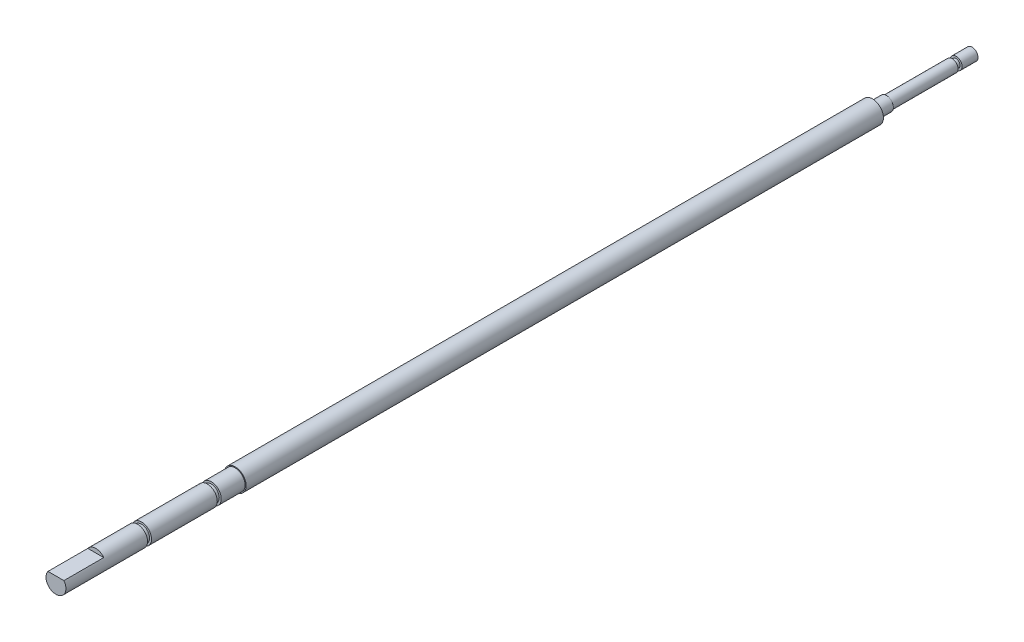
ISO-10303-21;
HEADER;
FILE_DESCRIPTION(('STEP AP214'),'2;1');
FILE_NAME('part.step','',(''),(''),'','','');
FILE_SCHEMA(('AUTOMOTIVE_DESIGN { 1 0 10303 214 1 1 1 1 }'));
ENDSEC;
DATA;
#1=APPLICATION_CONTEXT('core data for automotive mechanical design processes');
#2=APPLICATION_PROTOCOL_DEFINITION('international standard','automotive_design',2000,#1);
#3=PRODUCT_CONTEXT('',#1,'mechanical');
#4=PRODUCT('Part','Part','',(#3));
#5=PRODUCT_RELATED_PRODUCT_CATEGORY('part','',(#4));
#6=PRODUCT_DEFINITION_FORMATION('','',#4);
#7=PRODUCT_DEFINITION_CONTEXT('part definition',#1,'design');
#8=PRODUCT_DEFINITION('design','',#6,#7);
#9=PRODUCT_DEFINITION_SHAPE('','',#8);
#10=(LENGTH_UNIT() NAMED_UNIT(*) SI_UNIT(.MILLI.,.METRE.));
#11=(NAMED_UNIT(*) PLANE_ANGLE_UNIT() SI_UNIT($,.RADIAN.));
#12=(NAMED_UNIT(*) SI_UNIT($,.STERADIAN.) SOLID_ANGLE_UNIT());
#13=UNCERTAINTY_MEASURE_WITH_UNIT(LENGTH_MEASURE(1.E-05),#10,'distance_accuracy_value','');
#14=(GEOMETRIC_REPRESENTATION_CONTEXT(3) GLOBAL_UNCERTAINTY_ASSIGNED_CONTEXT((#13)) GLOBAL_UNIT_ASSIGNED_CONTEXT((#10,
#11,#12)) REPRESENTATION_CONTEXT('',''));
#15=CARTESIAN_POINT('',(0.,0.,0.));
#16=DIRECTION('',(0.,0.,1.));
#17=DIRECTION('',(1.,0.,0.));
#18=AXIS2_PLACEMENT_3D('',#15,#16,#17);
#19=CARTESIAN_POINT('',(-2.,1.5,220.));
#20=DIRECTION('',(0.,-1.,0.));
#21=DIRECTION('',(0.,0.,-1.));
#22=AXIS2_PLACEMENT_3D('',#19,#20,#21);
#23=PLANE('',#22);
#24=DIRECTION('',(-1.,0.,0.));
#25=VECTOR('',#24,1.);
#26=CARTESIAN_POINT('',(-2.,1.5,230.));
#27=LINE('',#26,#25);
#28=CARTESIAN_POINT('',(2.,1.5,230.));
#29=VERTEX_POINT('',#28);
#30=CARTESIAN_POINT('',(-2.,1.5,230.));
#31=VERTEX_POINT('',#30);
#32=EDGE_CURVE('E59',#29,#31,#27,.T.);
#33=ORIENTED_EDGE('',*,*,#32,.F.);
#34=DIRECTION('',(0.,0.,1.));
#35=VECTOR('',#34,1.);
#36=CARTESIAN_POINT('',(2.,1.5,220.));
#37=LINE('',#36,#35);
#38=CARTESIAN_POINT('',(2.,1.5,220.));
#39=VERTEX_POINT('',#38);
#40=EDGE_CURVE('E65',#39,#29,#37,.T.);
#41=ORIENTED_EDGE('',*,*,#40,.F.);
#42=DIRECTION('',(1.,0.,0.));
#43=VECTOR('',#42,1.);
#44=CARTESIAN_POINT('',(-2.,1.5,220.));
#45=LINE('',#44,#43);
#46=CARTESIAN_POINT('',(-2.,1.5,220.));
#47=VERTEX_POINT('',#46);
#48=EDGE_CURVE('E85',#47,#39,#45,.T.);
#49=ORIENTED_EDGE('',*,*,#48,.F.);
#50=DIRECTION('',(0.,0.,1.));
#51=VECTOR('',#50,1.);
#52=CARTESIAN_POINT('',(-2.,1.5,220.));
#53=LINE('',#52,#51);
#54=EDGE_CURVE('E75',#47,#31,#53,.T.);
#55=ORIENTED_EDGE('',*,*,#54,.T.);
#56=EDGE_LOOP('',(#33,#41,#49,#55));
#57=FACE_BOUND('',#56,.T.);
#58=ADVANCED_FACE('F45',(#57),#23,.F.);
#59=CARTESIAN_POINT('',(0.,0.,250.));
#60=DIRECTION('',(0.,0.,-1.));
#61=DIRECTION('',(-1.,0.,0.));
#62=AXIS2_PLACEMENT_3D('',#59,#60,#61);
#63=CYLINDRICAL_SURFACE('',#62,2.5);
#64=CARTESIAN_POINT('',(0.,0.,209.5));
#65=DIRECTION('',(0.,0.,1.));
#66=DIRECTION('',(1.,0.,0.));
#67=AXIS2_PLACEMENT_3D('',#64,#65,#66);
#68=CIRCLE('',#67,2.5);
#69=CARTESIAN_POINT('',(2.5,0.,209.5));
#70=VERTEX_POINT('',#69);
#71=EDGE_CURVE('E118',#70,#70,#68,.F.);
#72=ORIENTED_EDGE('',*,*,#71,.F.);
#73=EDGE_LOOP('',(#72));
#74=FACE_BOUND('',#73,.T.);
#75=ORIENTED_EDGE('',*,*,#40,.T.);
#76=CARTESIAN_POINT('',(0.,0.,230.));
#77=DIRECTION('',(0.,0.,1.));
#78=DIRECTION('',(1.,0.,0.));
#79=AXIS2_PLACEMENT_3D('',#76,#77,#78);
#80=CIRCLE('',#79,2.5);
#81=EDGE_CURVE('E13',#29,#31,#80,.F.);
#82=ORIENTED_EDGE('',*,*,#81,.T.);
#83=ORIENTED_EDGE('',*,*,#54,.F.);
#84=CARTESIAN_POINT('',(0.,0.,220.));
#85=DIRECTION('',(0.,0.,1.));
#86=DIRECTION('',(1.,0.,0.));
#87=AXIS2_PLACEMENT_3D('',#84,#85,#86);
#88=CIRCLE('',#87,2.5);
#89=EDGE_CURVE('E80',#39,#47,#88,.T.);
#90=ORIENTED_EDGE('',*,*,#89,.F.);
#91=EDGE_LOOP('',(#75,#82,#83,#90));
#92=FACE_BOUND('',#91,.T.);
#93=ADVANCED_FACE('F79',(#74,#92),#63,.T.);
#94=CARTESIAN_POINT('',(0.,0.,192.));
#95=DIRECTION('',(0.,0.,1.));
#96=DIRECTION('',(1.,0.,0.));
#97=AXIS2_PLACEMENT_3D('',#94,#95,#96);
#98=CIRCLE('',#97,2.5);
#99=CARTESIAN_POINT('',(2.5,0.,192.));
#100=VERTEX_POINT('',#99);
#101=EDGE_CURVE('E111',#100,#100,#98,.F.);
#102=ORIENTED_EDGE('',*,*,#101,.F.);
#103=EDGE_LOOP('',(#102));
#104=FACE_BOUND('',#103,.T.);
#105=CARTESIAN_POINT('',(0.,0.,208.5));
#106=DIRECTION('',(0.,0.,1.));
#107=DIRECTION('',(1.,0.,0.));
#108=AXIS2_PLACEMENT_3D('',#105,#106,#107);
#109=CIRCLE('',#108,2.5);
#110=CARTESIAN_POINT('',(2.5,0.,208.5));
#111=VERTEX_POINT('',#110);
#112=EDGE_CURVE('E116',#111,#111,#109,.F.);
#113=ORIENTED_EDGE('',*,*,#112,.T.);
#114=EDGE_LOOP('',(#113));
#115=FACE_BOUND('',#114,.T.);
#116=ADVANCED_FACE('F160',(#104,#115),#63,.T.);
#117=CARTESIAN_POINT('',(0.,0.,185.));
#118=DIRECTION('',(0.,0.,1.));
#119=DIRECTION('',(1.,0.,0.));
#120=AXIS2_PLACEMENT_3D('',#117,#118,#119);
#121=CIRCLE('',#120,2.5);
#122=CARTESIAN_POINT('',(2.5,0.,185.));
#123=VERTEX_POINT('',#122);
#124=EDGE_CURVE('E95',#123,#123,#121,.T.);
#125=ORIENTED_EDGE('',*,*,#124,.T.);
#126=EDGE_LOOP('',(#125));
#127=FACE_BOUND('',#126,.T.);
#128=CARTESIAN_POINT('',(0.,0.,191.));
#129=DIRECTION('',(0.,0.,1.));
#130=DIRECTION('',(1.,0.,0.));
#131=AXIS2_PLACEMENT_3D('',#128,#129,#130);
#132=CIRCLE('',#131,2.5);
#133=CARTESIAN_POINT('',(2.5,0.,191.));
#134=VERTEX_POINT('',#133);
#135=EDGE_CURVE('E108',#134,#134,#132,.F.);
#136=ORIENTED_EDGE('',*,*,#135,.T.);
#137=EDGE_LOOP('',(#136));
#138=FACE_BOUND('',#137,.T.);
#139=ADVANCED_FACE('F163',(#127,#138),#63,.T.);
#140=CARTESIAN_POINT('',(0.,0.,35.7019443787848));
#141=DIRECTION('',(0.,0.,-1.));
#142=DIRECTION('',(-1.,0.,0.));
#143=AXIS2_PLACEMENT_3D('',#140,#141,#142);
#144=CYLINDRICAL_SURFACE('',#143,1.5);
#145=CARTESIAN_POINT('',(0.,0.,21.5));
#146=DIRECTION('',(0.,0.,-1.));
#147=DIRECTION('',(-1.,0.,0.));
#148=AXIS2_PLACEMENT_3D('',#145,#146,#147);
#149=CIRCLE('',#148,1.5);
#150=CARTESIAN_POINT('',(-1.5,0.,21.5));
#151=VERTEX_POINT('',#150);
#152=EDGE_CURVE('E99',#151,#151,#149,.F.);
#153=ORIENTED_EDGE('',*,*,#152,.F.);
#154=EDGE_LOOP('',(#153));
#155=FACE_BOUND('',#154,.T.);
#156=CARTESIAN_POINT('',(0.,0.,5.));
#157=DIRECTION('',(0.,0.,-1.));
#158=DIRECTION('',(-1.,0.,0.));
#159=AXIS2_PLACEMENT_3D('',#156,#157,#158);
#160=CIRCLE('',#159,1.5);
#161=CARTESIAN_POINT('',(-1.5,0.,5.));
#162=VERTEX_POINT('',#161);
#163=EDGE_CURVE('E100',#162,#162,#160,.F.);
#164=ORIENTED_EDGE('',*,*,#163,.T.);
#165=EDGE_LOOP('',(#164));
#166=FACE_BOUND('',#165,.T.);
#167=ADVANCED_FACE('F168',(#155,#166),#144,.T.);
#168=CARTESIAN_POINT('',(0.,0.,25.));
#169=DIRECTION('',(0.,0.,-1.));
#170=DIRECTION('',(-1.,0.,0.));
#171=AXIS2_PLACEMENT_3D('',#168,#169,#170);
#172=CYLINDRICAL_SURFACE('',#171,1.75);
#173=CARTESIAN_POINT('',(0.,0.,25.));
#174=DIRECTION('',(0.,0.,-1.));
#175=DIRECTION('',(-1.,0.,0.));
#176=AXIS2_PLACEMENT_3D('',#173,#174,#175);
#177=CIRCLE('',#176,1.75);
#178=CARTESIAN_POINT('',(-1.75,0.,25.));
#179=VERTEX_POINT('',#178);
#180=EDGE_CURVE('E81',#179,#179,#177,.T.);
#181=ORIENTED_EDGE('',*,*,#180,.T.);
#182=EDGE_LOOP('',(#181));
#183=FACE_BOUND('',#182,.T.);
#184=CARTESIAN_POINT('',(0.,0.,21.5));
#185=DIRECTION('',(0.,0.,-1.));
#186=DIRECTION('',(-1.,0.,0.));
#187=AXIS2_PLACEMENT_3D('',#184,#185,#186);
#188=CIRCLE('',#187,1.75);
#189=CARTESIAN_POINT('',(-1.75,0.,21.5));
#190=VERTEX_POINT('',#189);
#191=EDGE_CURVE('E96',#190,#190,#188,.F.);
#192=ORIENTED_EDGE('',*,*,#191,.T.);
#193=EDGE_LOOP('',(#192));
#194=FACE_BOUND('',#193,.T.);
#195=ADVANCED_FACE('F165',(#183,#194),#172,.T.);
#196=CARTESIAN_POINT('',(0.,0.,250.));
#197=DIRECTION('',(0.,0.,-1.));
#198=DIRECTION('',(-1.,0.,0.));
#199=AXIS2_PLACEMENT_3D('',#196,#197,#198);
#200=CYLINDRICAL_SURFACE('',#199,2.75);
#201=CARTESIAN_POINT('',(0.,0.,25.));
#202=DIRECTION('',(0.,0.,-1.));
#203=DIRECTION('',(-1.,0.,0.));
#204=AXIS2_PLACEMENT_3D('',#201,#202,#203);
#205=CIRCLE('',#204,2.75);
#206=CARTESIAN_POINT('',(-2.75,0.,25.));
#207=VERTEX_POINT('',#206);
#208=EDGE_CURVE('E53',#207,#207,#205,.T.);
#209=ORIENTED_EDGE('',*,*,#208,.F.);
#210=EDGE_LOOP('',(#209));
#211=FACE_BOUND('',#210,.T.);
#212=CARTESIAN_POINT('',(0.,0.,185.));
#213=DIRECTION('',(0.,0.,1.));
#214=DIRECTION('',(1.,0.,0.));
#215=AXIS2_PLACEMENT_3D('',#212,#213,#214);
#216=CIRCLE('',#215,2.75);
#217=CARTESIAN_POINT('',(2.75,0.,185.));
#218=VERTEX_POINT('',#217);
#219=EDGE_CURVE('E92',#218,#218,#216,.T.);
#220=ORIENTED_EDGE('',*,*,#219,.F.);
#221=EDGE_LOOP('',(#220));
#222=FACE_BOUND('',#221,.T.);
#223=ADVANCED_FACE('F47',(#211,#222),#200,.T.);
#224=CARTESIAN_POINT('',(0.,0.,25.));
#225=DIRECTION('',(0.,0.,-1.));
#226=DIRECTION('',(-1.,0.,0.));
#227=AXIS2_PLACEMENT_3D('',#224,#225,#226);
#228=PLANE('',#227);
#229=ORIENTED_EDGE('',*,*,#180,.F.);
#230=EDGE_LOOP('',(#229));
#231=FACE_BOUND('',#230,.T.);
#232=ORIENTED_EDGE('',*,*,#208,.T.);
#233=EDGE_LOOP('',(#232));
#234=FACE_BOUND('',#233,.T.);
#235=ADVANCED_FACE('F170',(#231,#234),#228,.T.);
#236=CARTESIAN_POINT('',(0.,0.,185.));
#237=DIRECTION('',(0.,0.,1.));
#238=DIRECTION('',(1.,0.,0.));
#239=AXIS2_PLACEMENT_3D('',#236,#237,#238);
#240=PLANE('',#239);
#241=ORIENTED_EDGE('',*,*,#124,.F.);
#242=EDGE_LOOP('',(#241));
#243=FACE_BOUND('',#242,.T.);
#244=ORIENTED_EDGE('',*,*,#219,.T.);
#245=EDGE_LOOP('',(#244));
#246=FACE_BOUND('',#245,.T.);
#247=ADVANCED_FACE('F172',(#243,#246),#240,.T.);
#248=CARTESIAN_POINT('',(0.,0.,21.5));
#249=DIRECTION('',(0.,0.,-1.));
#250=DIRECTION('',(-1.,0.,0.));
#251=AXIS2_PLACEMENT_3D('',#248,#249,#250);
#252=PLANE('',#251);
#253=ORIENTED_EDGE('',*,*,#191,.F.);
#254=EDGE_LOOP('',(#253));
#255=FACE_BOUND('',#254,.T.);
#256=ORIENTED_EDGE('',*,*,#152,.T.);
#257=EDGE_LOOP('',(#256));
#258=FACE_BOUND('',#257,.T.);
#259=ADVANCED_FACE('F204',(#255,#258),#252,.T.);
#260=CARTESIAN_POINT('',(0.,0.,4.));
#261=DIRECTION('',(0.,0.,-1.));
#262=DIRECTION('',(-1.,0.,0.));
#263=AXIS2_PLACEMENT_3D('',#260,#261,#262);
#264=PLANE('',#263);
#265=CARTESIAN_POINT('',(0.,0.,4.));
#266=DIRECTION('',(0.,0.,-1.));
#267=DIRECTION('',(-1.,0.,0.));
#268=AXIS2_PLACEMENT_3D('',#265,#266,#267);
#269=CIRCLE('',#268,1.5);
#270=CARTESIAN_POINT('',(-1.5,0.,4.));
#271=VERTEX_POINT('',#270);
#272=EDGE_CURVE('E103',#271,#271,#269,.F.);
#273=ORIENTED_EDGE('',*,*,#272,.T.);
#274=EDGE_LOOP('',(#273));
#275=FACE_BOUND('',#274,.T.);
#276=CARTESIAN_POINT('',(0.,0.,4.));
#277=DIRECTION('',(0.,0.,-1.));
#278=DIRECTION('',(-1.,0.,0.));
#279=AXIS2_PLACEMENT_3D('',#276,#277,#278);
#280=CIRCLE('',#279,1.);
#281=CARTESIAN_POINT('',(-1.,0.,4.));
#282=VERTEX_POINT('',#281);
#283=EDGE_CURVE('E104',#282,#282,#280,.T.);
#284=ORIENTED_EDGE('',*,*,#283,.T.);
#285=EDGE_LOOP('',(#284));
#286=FACE_BOUND('',#285,.T.);
#287=ADVANCED_FACE('F194',(#275,#286),#264,.F.);
#288=CARTESIAN_POINT('',(0.,0.,5.));
#289=DIRECTION('',(0.,0.,-1.));
#290=DIRECTION('',(-1.,0.,0.));
#291=AXIS2_PLACEMENT_3D('',#288,#289,#290);
#292=PLANE('',#291);
#293=ORIENTED_EDGE('',*,*,#163,.F.);
#294=EDGE_LOOP('',(#293));
#295=FACE_BOUND('',#294,.T.);
#296=CARTESIAN_POINT('',(0.,0.,5.));
#297=DIRECTION('',(0.,0.,-1.));
#298=DIRECTION('',(-1.,0.,0.));
#299=AXIS2_PLACEMENT_3D('',#296,#297,#298);
#300=CIRCLE('',#299,1.);
#301=CARTESIAN_POINT('',(-1.,0.,5.));
#302=VERTEX_POINT('',#301);
#303=EDGE_CURVE('E115',#302,#302,#300,.T.);
#304=ORIENTED_EDGE('',*,*,#303,.F.);
#305=EDGE_LOOP('',(#304));
#306=FACE_BOUND('',#305,.T.);
#307=ADVANCED_FACE('F186',(#295,#306),#292,.T.);
#308=CARTESIAN_POINT('',(0.,0.,4.));
#309=DIRECTION('',(0.,0.,1.));
#310=DIRECTION('',(1.,0.,0.));
#311=AXIS2_PLACEMENT_3D('',#308,#309,#310);
#312=CYLINDRICAL_SURFACE('',#311,1.);
#313=ORIENTED_EDGE('',*,*,#283,.F.);
#314=EDGE_LOOP('',(#313));
#315=FACE_BOUND('',#314,.T.);
#316=ORIENTED_EDGE('',*,*,#303,.T.);
#317=EDGE_LOOP('',(#316));
#318=FACE_BOUND('',#317,.T.);
#319=ADVANCED_FACE('F177',(#315,#318),#312,.T.);
#320=CARTESIAN_POINT('',(0.,0.,0.));
#321=DIRECTION('',(0.,0.,1.));
#322=DIRECTION('',(1.,0.,0.));
#323=AXIS2_PLACEMENT_3D('',#320,#321,#322);
#324=PLANE('',#323);
#325=CARTESIAN_POINT('',(0.,0.,0.));
#326=DIRECTION('',(0.,0.,-1.));
#327=DIRECTION('',(-1.,0.,0.));
#328=AXIS2_PLACEMENT_3D('',#325,#326,#327);
#329=CIRCLE('',#328,1.5);
#330=CARTESIAN_POINT('',(-1.5,0.,0.));
#331=VERTEX_POINT('',#330);
#332=EDGE_CURVE('E107',#331,#331,#329,.T.);
#333=ORIENTED_EDGE('',*,*,#332,.T.);
#334=EDGE_LOOP('',(#333));
#335=FACE_BOUND('',#334,.T.);
#336=ADVANCED_FACE('F174',(#335),#324,.F.);
#337=ORIENTED_EDGE('',*,*,#272,.F.);
#338=EDGE_LOOP('',(#337));
#339=FACE_BOUND('',#338,.T.);
#340=ORIENTED_EDGE('',*,*,#332,.F.);
#341=EDGE_LOOP('',(#340));
#342=FACE_BOUND('',#341,.T.);
#343=ADVANCED_FACE('F176',(#339,#342),#144,.T.);
#344=CARTESIAN_POINT('',(0.,0.,192.));
#345=DIRECTION('',(0.,0.,1.));
#346=DIRECTION('',(1.,0.,0.));
#347=AXIS2_PLACEMENT_3D('',#344,#345,#346);
#348=PLANE('',#347);
#349=ORIENTED_EDGE('',*,*,#101,.T.);
#350=EDGE_LOOP('',(#349));
#351=FACE_BOUND('',#350,.T.);
#352=CARTESIAN_POINT('',(0.,0.,192.));
#353=DIRECTION('',(0.,0.,1.));
#354=DIRECTION('',(1.,0.,0.));
#355=AXIS2_PLACEMENT_3D('',#352,#353,#354);
#356=CIRCLE('',#355,2.);
#357=CARTESIAN_POINT('',(2.,0.,192.));
#358=VERTEX_POINT('',#357);
#359=EDGE_CURVE('E112',#358,#358,#356,.T.);
#360=ORIENTED_EDGE('',*,*,#359,.T.);
#361=EDGE_LOOP('',(#360));
#362=FACE_BOUND('',#361,.T.);
#363=ADVANCED_FACE('F183',(#351,#362),#348,.F.);
#364=CARTESIAN_POINT('',(0.,0.,191.));
#365=DIRECTION('',(0.,0.,1.));
#366=DIRECTION('',(1.,0.,0.));
#367=AXIS2_PLACEMENT_3D('',#364,#365,#366);
#368=PLANE('',#367);
#369=ORIENTED_EDGE('',*,*,#135,.F.);
#370=EDGE_LOOP('',(#369));
#371=FACE_BOUND('',#370,.T.);
#372=CARTESIAN_POINT('',(0.,0.,191.));
#373=DIRECTION('',(0.,0.,1.));
#374=DIRECTION('',(1.,0.,0.));
#375=AXIS2_PLACEMENT_3D('',#372,#373,#374);
#376=CIRCLE('',#375,2.);
#377=CARTESIAN_POINT('',(2.,0.,191.));
#378=VERTEX_POINT('',#377);
#379=EDGE_CURVE('E121',#378,#378,#376,.T.);
#380=ORIENTED_EDGE('',*,*,#379,.F.);
#381=EDGE_LOOP('',(#380));
#382=FACE_BOUND('',#381,.T.);
#383=ADVANCED_FACE('F201',(#371,#382),#368,.T.);
#384=CARTESIAN_POINT('',(0.,0.,192.));
#385=DIRECTION('',(0.,0.,-1.));
#386=DIRECTION('',(-1.,0.,0.));
#387=AXIS2_PLACEMENT_3D('',#384,#385,#386);
#388=CYLINDRICAL_SURFACE('',#387,2.);
#389=ORIENTED_EDGE('',*,*,#359,.F.);
#390=EDGE_LOOP('',(#389));
#391=FACE_BOUND('',#390,.T.);
#392=ORIENTED_EDGE('',*,*,#379,.T.);
#393=EDGE_LOOP('',(#392));
#394=FACE_BOUND('',#393,.T.);
#395=ADVANCED_FACE('F317',(#391,#394),#388,.T.);
#396=CARTESIAN_POINT('',(0.,0.,209.5));
#397=DIRECTION('',(0.,0.,1.));
#398=DIRECTION('',(1.,0.,0.));
#399=AXIS2_PLACEMENT_3D('',#396,#397,#398);
#400=PLANE('',#399);
#401=ORIENTED_EDGE('',*,*,#71,.T.);
#402=EDGE_LOOP('',(#401));
#403=FACE_BOUND('',#402,.T.);
#404=CARTESIAN_POINT('',(0.,0.,209.5));
#405=DIRECTION('',(0.,0.,1.));
#406=DIRECTION('',(1.,0.,0.));
#407=AXIS2_PLACEMENT_3D('',#404,#405,#406);
#408=CIRCLE('',#407,2.);
#409=CARTESIAN_POINT('',(2.,0.,209.5));
#410=VERTEX_POINT('',#409);
#411=EDGE_CURVE('E119',#410,#410,#408,.T.);
#412=ORIENTED_EDGE('',*,*,#411,.T.);
#413=EDGE_LOOP('',(#412));
#414=FACE_BOUND('',#413,.T.);
#415=ADVANCED_FACE('F326',(#403,#414),#400,.F.);
#416=CARTESIAN_POINT('',(0.,0.,208.5));
#417=DIRECTION('',(0.,0.,1.));
#418=DIRECTION('',(1.,0.,0.));
#419=AXIS2_PLACEMENT_3D('',#416,#417,#418);
#420=PLANE('',#419);
#421=ORIENTED_EDGE('',*,*,#112,.F.);
#422=EDGE_LOOP('',(#421));
#423=FACE_BOUND('',#422,.T.);
#424=CARTESIAN_POINT('',(0.,0.,208.5));
#425=DIRECTION('',(0.,0.,1.));
#426=DIRECTION('',(1.,0.,0.));
#427=AXIS2_PLACEMENT_3D('',#424,#425,#426);
#428=CIRCLE('',#427,2.);
#429=CARTESIAN_POINT('',(2.,0.,208.5));
#430=VERTEX_POINT('',#429);
#431=EDGE_CURVE('E76',#430,#430,#428,.T.);
#432=ORIENTED_EDGE('',*,*,#431,.F.);
#433=EDGE_LOOP('',(#432));
#434=FACE_BOUND('',#433,.T.);
#435=ADVANCED_FACE('F151',(#423,#434),#420,.T.);
#436=CARTESIAN_POINT('',(0.,0.,209.5));
#437=DIRECTION('',(0.,0.,-1.));
#438=DIRECTION('',(-1.,0.,0.));
#439=AXIS2_PLACEMENT_3D('',#436,#437,#438);
#440=CYLINDRICAL_SURFACE('',#439,2.);
#441=ORIENTED_EDGE('',*,*,#411,.F.);
#442=EDGE_LOOP('',(#441));
#443=FACE_BOUND('',#442,.T.);
#444=ORIENTED_EDGE('',*,*,#431,.T.);
#445=EDGE_LOOP('',(#444));
#446=FACE_BOUND('',#445,.T.);
#447=ADVANCED_FACE('F144',(#443,#446),#440,.T.);
#448=CARTESIAN_POINT('',(0.,0.,220.));
#449=DIRECTION('',(0.,0.,1.));
#450=DIRECTION('',(1.,0.,0.));
#451=AXIS2_PLACEMENT_3D('',#448,#449,#450);
#452=PLANE('',#451);
#453=ORIENTED_EDGE('',*,*,#89,.T.);
#454=ORIENTED_EDGE('',*,*,#48,.T.);
#455=EDGE_LOOP('',(#453,#454));
#456=FACE_BOUND('',#455,.T.);
#457=ADVANCED_FACE('F142',(#456),#452,.T.);
#458=CARTESIAN_POINT('',(0.,0.,230.));
#459=DIRECTION('',(0.,0.,1.));
#460=DIRECTION('',(1.,0.,0.));
#461=AXIS2_PLACEMENT_3D('',#458,#459,#460);
#462=PLANE('',#461);
#463=ORIENTED_EDGE('',*,*,#32,.T.);
#464=ORIENTED_EDGE('',*,*,#81,.F.);
#465=EDGE_LOOP('',(#463,#464));
#466=FACE_BOUND('',#465,.T.);
#467=ADVANCED_FACE('F71',(#466),#462,.T.);
#468=CLOSED_SHELL('',(#58,#93,#116,#139,#167,#195,#223,#235,#247,#259,#287,#307,#319,#336,#343,
#363,#383,#395,#415,#435,#447,#457,#467));
#469=MANIFOLD_SOLID_BREP('B2',#468);
#470=ADVANCED_BREP_SHAPE_REPRESENTATION('',(#18,#469),#14);
#471=SHAPE_DEFINITION_REPRESENTATION(#9,#470);
ENDSEC;
END-ISO-10303-21;
